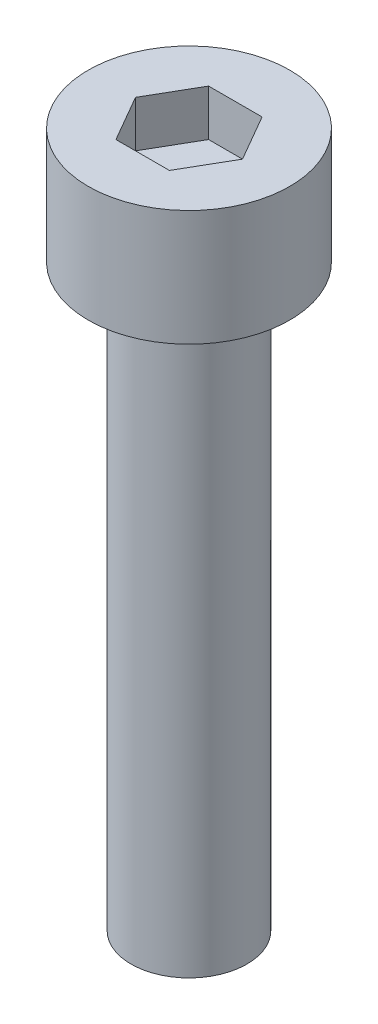
ISO-10303-21;
HEADER;
FILE_DESCRIPTION(('STEP AP214'),'2;1');
FILE_NAME('part.step','',(''),(''),'','','');
FILE_SCHEMA(('AUTOMOTIVE_DESIGN { 1 0 10303 214 1 1 1 1 }'));
ENDSEC;
DATA;
#1=APPLICATION_CONTEXT('core data for automotive mechanical design processes');
#2=APPLICATION_PROTOCOL_DEFINITION('international standard','automotive_design',2000,#1);
#3=PRODUCT_CONTEXT('',#1,'mechanical');
#4=PRODUCT('Part','Part','',(#3));
#5=PRODUCT_RELATED_PRODUCT_CATEGORY('part','',(#4));
#6=PRODUCT_DEFINITION_FORMATION('','',#4);
#7=PRODUCT_DEFINITION_CONTEXT('part definition',#1,'design');
#8=PRODUCT_DEFINITION('design','',#6,#7);
#9=PRODUCT_DEFINITION_SHAPE('','',#8);
#10=(LENGTH_UNIT() NAMED_UNIT(*) SI_UNIT(.MILLI.,.METRE.));
#11=(NAMED_UNIT(*) PLANE_ANGLE_UNIT() SI_UNIT($,.RADIAN.));
#12=(NAMED_UNIT(*) SI_UNIT($,.STERADIAN.) SOLID_ANGLE_UNIT());
#13=UNCERTAINTY_MEASURE_WITH_UNIT(LENGTH_MEASURE(1.E-05),#10,'distance_accuracy_value','');
#14=(GEOMETRIC_REPRESENTATION_CONTEXT(3) GLOBAL_UNCERTAINTY_ASSIGNED_CONTEXT((#13)) GLOBAL_UNIT_ASSIGNED_CONTEXT((#10,
#11,#12)) REPRESENTATION_CONTEXT('',''));
#15=CARTESIAN_POINT('',(0.,0.,0.));
#16=DIRECTION('',(0.,0.,1.));
#17=DIRECTION('',(1.,0.,0.));
#18=AXIS2_PLACEMENT_3D('',#15,#16,#17);
#19=CARTESIAN_POINT('',(0.,5.,0.));
#20=DIRECTION('',(0.,-1.,0.));
#21=DIRECTION('',(0.,0.,-1.));
#22=AXIS2_PLACEMENT_3D('',#19,#20,#21);
#23=CYLINDRICAL_SURFACE('',#22,4.35);
#24=CARTESIAN_POINT('',(0.,5.,0.));
#25=DIRECTION('',(0.,1.,0.));
#26=DIRECTION('',(0.,0.,1.));
#27=AXIS2_PLACEMENT_3D('',#24,#25,#26);
#28=CIRCLE('',#27,4.35);
#29=CARTESIAN_POINT('',(0.,5.,4.35));
#30=VERTEX_POINT('',#29);
#31=EDGE_CURVE('E52',#30,#30,#28,.T.);
#32=ORIENTED_EDGE('',*,*,#31,.F.);
#33=EDGE_LOOP('',(#32));
#34=FACE_BOUND('',#33,.T.);
#35=CARTESIAN_POINT('',(0.,0.,0.));
#36=DIRECTION('',(0.,1.,0.));
#37=DIRECTION('',(0.,0.,1.));
#38=AXIS2_PLACEMENT_3D('',#35,#36,#37);
#39=CIRCLE('',#38,4.35);
#40=CARTESIAN_POINT('',(0.,0.,4.35));
#41=VERTEX_POINT('',#40);
#42=EDGE_CURVE('E46',#41,#41,#39,.T.);
#43=ORIENTED_EDGE('',*,*,#42,.T.);
#44=EDGE_LOOP('',(#43));
#45=FACE_BOUND('',#44,.T.);
#46=ADVANCED_FACE('F43',(#34,#45),#23,.T.);
#47=CARTESIAN_POINT('',(0.,5.,0.));
#48=DIRECTION('',(0.,1.,0.));
#49=DIRECTION('',(0.,0.,1.));
#50=AXIS2_PLACEMENT_3D('',#47,#48,#49);
#51=PLANE('',#50);
#52=DIRECTION('',(0.5,0.,-0.866025403784439));
#53=VECTOR('',#52,1.);
#54=CARTESIAN_POINT('',(1.15470053837925,5.,2.));
#55=LINE('',#54,#53);
#56=CARTESIAN_POINT('',(1.15470053837925,5.,2.));
#57=VERTEX_POINT('',#56);
#58=CARTESIAN_POINT('',(2.3094010767585,5.,0.));
#59=VERTEX_POINT('',#58);
#60=EDGE_CURVE('E60',#57,#59,#55,.T.);
#61=ORIENTED_EDGE('',*,*,#60,.F.);
#62=DIRECTION('',(1.,0.,0.));
#63=VECTOR('',#62,1.);
#64=CARTESIAN_POINT('',(-1.15470053837925,5.,2.));
#65=LINE('',#64,#63);
#66=CARTESIAN_POINT('',(-1.15470053837925,5.,2.));
#67=VERTEX_POINT('',#66);
#68=EDGE_CURVE('E154',#67,#57,#65,.T.);
#69=ORIENTED_EDGE('',*,*,#68,.F.);
#70=DIRECTION('',(0.5,0.,0.866025403784438));
#71=VECTOR('',#70,1.);
#72=CARTESIAN_POINT('',(-2.3094010767585,5.,0.));
#73=LINE('',#72,#71);
#74=CARTESIAN_POINT('',(-2.3094010767585,5.,0.));
#75=VERTEX_POINT('',#74);
#76=EDGE_CURVE('E151',#75,#67,#73,.T.);
#77=ORIENTED_EDGE('',*,*,#76,.F.);
#78=DIRECTION('',(-0.5,0.,0.866025403784439));
#79=VECTOR('',#78,1.);
#80=CARTESIAN_POINT('',(-1.15470053837925,5.,-2.));
#81=LINE('',#80,#79);
#82=CARTESIAN_POINT('',(-1.15470053837925,5.,-2.));
#83=VERTEX_POINT('',#82);
#84=EDGE_CURVE('E108',#83,#75,#81,.T.);
#85=ORIENTED_EDGE('',*,*,#84,.F.);
#86=DIRECTION('',(-1.,0.,0.));
#87=VECTOR('',#86,1.);
#88=CARTESIAN_POINT('',(1.15470053837925,5.,-2.));
#89=LINE('',#88,#87);
#90=CARTESIAN_POINT('',(1.15470053837925,5.,-2.));
#91=VERTEX_POINT('',#90);
#92=EDGE_CURVE('E145',#91,#83,#89,.T.);
#93=ORIENTED_EDGE('',*,*,#92,.F.);
#94=DIRECTION('',(-0.5,0.,-0.866025403784438));
#95=VECTOR('',#94,1.);
#96=CARTESIAN_POINT('',(2.3094010767585,5.,0.));
#97=LINE('',#96,#95);
#98=EDGE_CURVE('E140',#59,#91,#97,.T.);
#99=ORIENTED_EDGE('',*,*,#98,.F.);
#100=EDGE_LOOP('',(#61,#69,#77,#85,#93,#99));
#101=FACE_BOUND('',#100,.T.);
#102=ORIENTED_EDGE('',*,*,#31,.T.);
#103=EDGE_LOOP('',(#102));
#104=FACE_BOUND('',#103,.T.);
#105=ADVANCED_FACE('F180',(#101,#104),#51,.T.);
#106=CARTESIAN_POINT('',(0.,0.,0.));
#107=DIRECTION('',(0.,1.,0.));
#108=DIRECTION('',(0.,0.,1.));
#109=AXIS2_PLACEMENT_3D('',#106,#107,#108);
#110=PLANE('',#109);
#111=CARTESIAN_POINT('',(0.,0.,0.));
#112=DIRECTION('',(0.,-1.,0.));
#113=DIRECTION('',(0.,0.,-1.));
#114=AXIS2_PLACEMENT_3D('',#111,#112,#113);
#115=CIRCLE('',#114,2.5);
#116=CARTESIAN_POINT('',(0.,0.,-2.5));
#117=VERTEX_POINT('',#116);
#118=EDGE_CURVE('E11',#117,#117,#115,.T.);
#119=ORIENTED_EDGE('',*,*,#118,.F.);
#120=EDGE_LOOP('',(#119));
#121=FACE_BOUND('',#120,.T.);
#122=ORIENTED_EDGE('',*,*,#42,.F.);
#123=EDGE_LOOP('',(#122));
#124=FACE_BOUND('',#123,.T.);
#125=ADVANCED_FACE('F177',(#121,#124),#110,.F.);
#126=CARTESIAN_POINT('',(1.15470053837925,3.,2.));
#127=DIRECTION('',(0.866025403784438,0.,0.5));
#128=DIRECTION('',(0.5,0.,-0.866025403784439));
#129=AXIS2_PLACEMENT_3D('',#126,#127,#128);
#130=PLANE('',#129);
#131=ORIENTED_EDGE('',*,*,#60,.T.);
#132=DIRECTION('',(0.,1.,0.));
#133=VECTOR('',#132,1.);
#134=CARTESIAN_POINT('',(2.3094010767585,3.,0.));
#135=LINE('',#134,#133);
#136=CARTESIAN_POINT('',(2.3094010767585,3.,0.));
#137=VERTEX_POINT('',#136);
#138=EDGE_CURVE('E90',#137,#59,#135,.T.);
#139=ORIENTED_EDGE('',*,*,#138,.F.);
#140=DIRECTION('',(0.5,0.,-0.866025403784439));
#141=VECTOR('',#140,1.);
#142=CARTESIAN_POINT('',(1.15470053837925,3.,2.));
#143=LINE('',#142,#141);
#144=CARTESIAN_POINT('',(1.15470053837925,3.,2.));
#145=VERTEX_POINT('',#144);
#146=EDGE_CURVE('E157',#145,#137,#143,.T.);
#147=ORIENTED_EDGE('',*,*,#146,.F.);
#148=DIRECTION('',(0.,1.,0.));
#149=VECTOR('',#148,1.);
#150=CARTESIAN_POINT('',(1.15470053837925,3.,2.));
#151=LINE('',#150,#149);
#152=EDGE_CURVE('E68',#145,#57,#151,.T.);
#153=ORIENTED_EDGE('',*,*,#152,.T.);
#154=EDGE_LOOP('',(#131,#139,#147,#153));
#155=FACE_BOUND('',#154,.T.);
#156=ADVANCED_FACE('F179',(#155),#130,.F.);
#157=CARTESIAN_POINT('',(-1.15470053837925,3.,2.));
#158=DIRECTION('',(0.,0.,1.));
#159=DIRECTION('',(1.,0.,0.));
#160=AXIS2_PLACEMENT_3D('',#157,#158,#159);
#161=PLANE('',#160);
#162=ORIENTED_EDGE('',*,*,#68,.T.);
#163=ORIENTED_EDGE('',*,*,#152,.F.);
#164=DIRECTION('',(1.,0.,0.));
#165=VECTOR('',#164,1.);
#166=CARTESIAN_POINT('',(-1.15470053837925,3.,2.));
#167=LINE('',#166,#165);
#168=CARTESIAN_POINT('',(-1.15470053837925,3.,2.));
#169=VERTEX_POINT('',#168);
#170=EDGE_CURVE('E122',#169,#145,#167,.T.);
#171=ORIENTED_EDGE('',*,*,#170,.F.);
#172=DIRECTION('',(0.,1.,0.));
#173=VECTOR('',#172,1.);
#174=CARTESIAN_POINT('',(-1.15470053837925,3.,2.));
#175=LINE('',#174,#173);
#176=EDGE_CURVE('E113',#169,#67,#175,.T.);
#177=ORIENTED_EDGE('',*,*,#176,.T.);
#178=EDGE_LOOP('',(#162,#163,#171,#177));
#179=FACE_BOUND('',#178,.T.);
#180=ADVANCED_FACE('F186',(#179),#161,.F.);
#181=CARTESIAN_POINT('',(-2.3094010767585,3.,0.));
#182=DIRECTION('',(-0.866025403784438,0.,0.5));
#183=DIRECTION('',(0.5,0.,0.866025403784439));
#184=AXIS2_PLACEMENT_3D('',#181,#182,#183);
#185=PLANE('',#184);
#186=ORIENTED_EDGE('',*,*,#76,.T.);
#187=ORIENTED_EDGE('',*,*,#176,.F.);
#188=DIRECTION('',(0.5,0.,0.866025403784438));
#189=VECTOR('',#188,1.);
#190=CARTESIAN_POINT('',(-2.3094010767585,3.,0.));
#191=LINE('',#190,#189);
#192=CARTESIAN_POINT('',(-2.3094010767585,3.,0.));
#193=VERTEX_POINT('',#192);
#194=EDGE_CURVE('E117',#193,#169,#191,.T.);
#195=ORIENTED_EDGE('',*,*,#194,.F.);
#196=DIRECTION('',(0.,1.,0.));
#197=VECTOR('',#196,1.);
#198=CARTESIAN_POINT('',(-2.3094010767585,3.,0.));
#199=LINE('',#198,#197);
#200=EDGE_CURVE('E101',#193,#75,#199,.T.);
#201=ORIENTED_EDGE('',*,*,#200,.T.);
#202=EDGE_LOOP('',(#186,#187,#195,#201));
#203=FACE_BOUND('',#202,.T.);
#204=ADVANCED_FACE('F118',(#203),#185,.F.);
#205=CARTESIAN_POINT('',(-1.15470053837925,3.,-2.));
#206=DIRECTION('',(-0.866025403784439,0.,-0.5));
#207=DIRECTION('',(-0.5,0.,0.866025403784439));
#208=AXIS2_PLACEMENT_3D('',#205,#206,#207);
#209=PLANE('',#208);
#210=ORIENTED_EDGE('',*,*,#84,.T.);
#211=ORIENTED_EDGE('',*,*,#200,.F.);
#212=DIRECTION('',(-0.5,0.,0.866025403784439));
#213=VECTOR('',#212,1.);
#214=CARTESIAN_POINT('',(-1.15470053837925,3.,-2.));
#215=LINE('',#214,#213);
#216=CARTESIAN_POINT('',(-1.15470053837925,3.,-2.));
#217=VERTEX_POINT('',#216);
#218=EDGE_CURVE('E105',#217,#193,#215,.T.);
#219=ORIENTED_EDGE('',*,*,#218,.F.);
#220=DIRECTION('',(0.,1.,0.));
#221=VECTOR('',#220,1.);
#222=CARTESIAN_POINT('',(-1.15470053837925,3.,-2.));
#223=LINE('',#222,#221);
#224=EDGE_CURVE('E114',#217,#83,#223,.T.);
#225=ORIENTED_EDGE('',*,*,#224,.T.);
#226=EDGE_LOOP('',(#210,#211,#219,#225));
#227=FACE_BOUND('',#226,.T.);
#228=ADVANCED_FACE('F103',(#227),#209,.F.);
#229=CARTESIAN_POINT('',(1.15470053837925,3.,-2.));
#230=DIRECTION('',(0.,0.,-1.));
#231=DIRECTION('',(-1.,0.,0.));
#232=AXIS2_PLACEMENT_3D('',#229,#230,#231);
#233=PLANE('',#232);
#234=ORIENTED_EDGE('',*,*,#92,.T.);
#235=ORIENTED_EDGE('',*,*,#224,.F.);
#236=DIRECTION('',(-1.,0.,0.));
#237=VECTOR('',#236,1.);
#238=CARTESIAN_POINT('',(1.15470053837925,3.,-2.));
#239=LINE('',#238,#237);
#240=CARTESIAN_POINT('',(1.15470053837925,3.,-2.));
#241=VERTEX_POINT('',#240);
#242=EDGE_CURVE('E128',#241,#217,#239,.T.);
#243=ORIENTED_EDGE('',*,*,#242,.F.);
#244=DIRECTION('',(0.,1.,0.));
#245=VECTOR('',#244,1.);
#246=CARTESIAN_POINT('',(1.15470053837925,3.,-2.));
#247=LINE('',#246,#245);
#248=EDGE_CURVE('E164',#241,#91,#247,.T.);
#249=ORIENTED_EDGE('',*,*,#248,.T.);
#250=EDGE_LOOP('',(#234,#235,#243,#249));
#251=FACE_BOUND('',#250,.T.);
#252=ADVANCED_FACE('F235',(#251),#233,.F.);
#253=CARTESIAN_POINT('',(2.3094010767585,3.,0.));
#254=DIRECTION('',(0.866025403784438,0.,-0.5));
#255=DIRECTION('',(-0.5,0.,-0.866025403784438));
#256=AXIS2_PLACEMENT_3D('',#253,#254,#255);
#257=PLANE('',#256);
#258=ORIENTED_EDGE('',*,*,#98,.T.);
#259=ORIENTED_EDGE('',*,*,#248,.F.);
#260=DIRECTION('',(-0.5,0.,-0.866025403784438));
#261=VECTOR('',#260,1.);
#262=CARTESIAN_POINT('',(2.3094010767585,3.,0.));
#263=LINE('',#262,#261);
#264=EDGE_CURVE('E132',#137,#241,#263,.T.);
#265=ORIENTED_EDGE('',*,*,#264,.F.);
#266=ORIENTED_EDGE('',*,*,#138,.T.);
#267=EDGE_LOOP('',(#258,#259,#265,#266));
#268=FACE_BOUND('',#267,.T.);
#269=ADVANCED_FACE('F245',(#268),#257,.F.);
#270=CARTESIAN_POINT('',(0.,3.,0.));
#271=DIRECTION('',(0.,1.,0.));
#272=DIRECTION('',(0.,0.,1.));
#273=AXIS2_PLACEMENT_3D('',#270,#271,#272);
#274=PLANE('',#273);
#275=ORIENTED_EDGE('',*,*,#146,.T.);
#276=ORIENTED_EDGE('',*,*,#264,.T.);
#277=ORIENTED_EDGE('',*,*,#242,.T.);
#278=ORIENTED_EDGE('',*,*,#218,.T.);
#279=ORIENTED_EDGE('',*,*,#194,.T.);
#280=ORIENTED_EDGE('',*,*,#170,.T.);
#281=EDGE_LOOP('',(#275,#276,#277,#278,#279,#280));
#282=FACE_BOUND('',#281,.T.);
#283=ADVANCED_FACE('F125',(#282),#274,.T.);
#284=CARTESIAN_POINT('',(0.,-25.,0.));
#285=DIRECTION('',(0.,1.,0.));
#286=DIRECTION('',(0.,0.,1.));
#287=AXIS2_PLACEMENT_3D('',#284,#285,#286);
#288=CYLINDRICAL_SURFACE('',#287,2.5);
#289=CARTESIAN_POINT('',(0.,-25.,0.));
#290=DIRECTION('',(0.,-1.,0.));
#291=DIRECTION('',(0.,0.,-1.));
#292=AXIS2_PLACEMENT_3D('',#289,#290,#291);
#293=CIRCLE('',#292,2.5);
#294=CARTESIAN_POINT('',(0.,-25.,-2.5));
#295=VERTEX_POINT('',#294);
#296=EDGE_CURVE('E141',#295,#295,#293,.T.);
#297=ORIENTED_EDGE('',*,*,#296,.F.);
#298=EDGE_LOOP('',(#297));
#299=FACE_BOUND('',#298,.T.);
#300=ORIENTED_EDGE('',*,*,#118,.T.);
#301=EDGE_LOOP('',(#300));
#302=FACE_BOUND('',#301,.T.);
#303=ADVANCED_FACE('F265',(#299,#302),#288,.T.);
#304=CARTESIAN_POINT('',(0.,-25.,0.));
#305=DIRECTION('',(0.,-1.,0.));
#306=DIRECTION('',(0.,0.,-1.));
#307=AXIS2_PLACEMENT_3D('',#304,#305,#306);
#308=PLANE('',#307);
#309=ORIENTED_EDGE('',*,*,#296,.T.);
#310=EDGE_LOOP('',(#309));
#311=FACE_BOUND('',#310,.T.);
#312=ADVANCED_FACE('F280',(#311),#308,.T.);
#313=CLOSED_SHELL('',(#46,#105,#125,#156,#180,#204,#228,#252,#269,#283,#303,#312));
#314=MANIFOLD_SOLID_BREP('B2',#313);
#315=ADVANCED_BREP_SHAPE_REPRESENTATION('',(#18,#314),#14);
#316=SHAPE_DEFINITION_REPRESENTATION(#9,#315);
ENDSEC;
END-ISO-10303-21;
